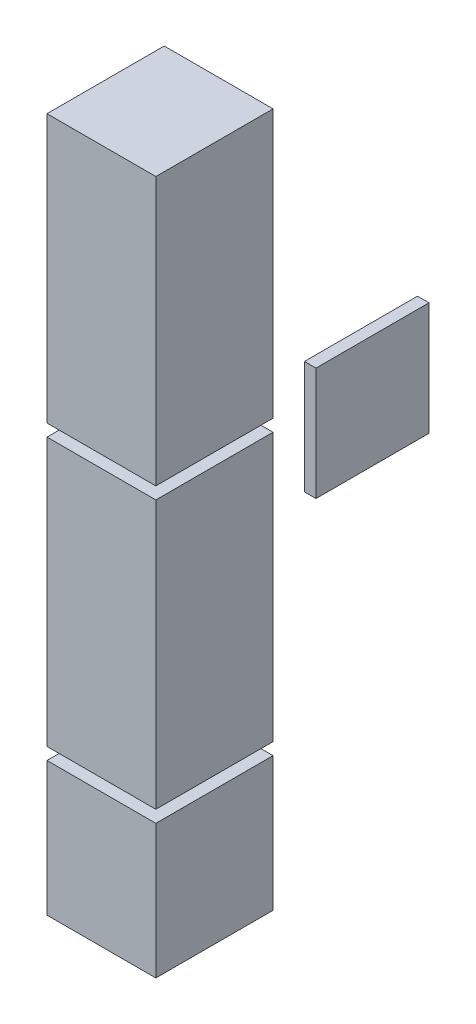
ISO-10303-21;
HEADER;
FILE_DESCRIPTION(('STEP AP214'),'2;1');
FILE_NAME('part.step','',(''),(''),'','','');
FILE_SCHEMA(('AUTOMOTIVE_DESIGN { 1 0 10303 214 1 1 1 1 }'));
ENDSEC;
DATA;
#1=APPLICATION_CONTEXT('core data for automotive mechanical design processes');
#2=APPLICATION_PROTOCOL_DEFINITION('international standard','automotive_design',2000,#1);
#3=PRODUCT_CONTEXT('',#1,'mechanical');
#4=PRODUCT('Part','Part','',(#3));
#5=PRODUCT_RELATED_PRODUCT_CATEGORY('part','',(#4));
#6=PRODUCT_DEFINITION_FORMATION('','',#4);
#7=PRODUCT_DEFINITION_CONTEXT('part definition',#1,'design');
#8=PRODUCT_DEFINITION('design','',#6,#7);
#9=PRODUCT_DEFINITION_SHAPE('','',#8);
#10=(LENGTH_UNIT() NAMED_UNIT(*) SI_UNIT(.MILLI.,.METRE.));
#11=(NAMED_UNIT(*) PLANE_ANGLE_UNIT() SI_UNIT($,.RADIAN.));
#12=(NAMED_UNIT(*) SI_UNIT($,.STERADIAN.) SOLID_ANGLE_UNIT());
#13=UNCERTAINTY_MEASURE_WITH_UNIT(LENGTH_MEASURE(1.E-05),#10,'distance_accuracy_value','');
#14=(GEOMETRIC_REPRESENTATION_CONTEXT(3) GLOBAL_UNCERTAINTY_ASSIGNED_CONTEXT((#13)) GLOBAL_UNIT_ASSIGNED_CONTEXT((#10,
#11,#12)) REPRESENTATION_CONTEXT('',''));
#15=CARTESIAN_POINT('',(0.,0.,0.));
#16=DIRECTION('',(0.,0.,1.));
#17=DIRECTION('',(1.,0.,0.));
#18=AXIS2_PLACEMENT_3D('',#15,#16,#17);
#19=CARTESIAN_POINT('',(4.3375,133.,-56.5));
#20=DIRECTION('',(0.,0.,-1.));
#21=DIRECTION('',(-1.,0.,0.));
#22=AXIS2_PLACEMENT_3D('',#19,#20,#21);
#23=PLANE('',#22);
#24=DIRECTION('',(0.,-1.,0.));
#25=VECTOR('',#24,1.);
#26=CARTESIAN_POINT('',(1.5875,133.,-56.5));
#27=LINE('',#26,#25);
#28=CARTESIAN_POINT('',(1.5875,133.,-56.5));
#29=VERTEX_POINT('',#28);
#30=CARTESIAN_POINT('',(1.5875,106.,-56.5));
#31=VERTEX_POINT('',#30);
#32=EDGE_CURVE('E107',#29,#31,#27,.T.);
#33=ORIENTED_EDGE('',*,*,#32,.T.);
#34=DIRECTION('',(-1.,0.,0.));
#35=VECTOR('',#34,1.);
#36=CARTESIAN_POINT('',(4.3375,106.,-56.5));
#37=LINE('',#36,#35);
#38=CARTESIAN_POINT('',(4.3375,106.,-56.5));
#39=VERTEX_POINT('',#38);
#40=EDGE_CURVE('E12',#39,#31,#37,.T.);
#41=ORIENTED_EDGE('',*,*,#40,.F.);
#42=DIRECTION('',(0.,-1.,0.));
#43=VECTOR('',#42,1.);
#44=CARTESIAN_POINT('',(4.3375,133.,-56.5));
#45=LINE('',#44,#43);
#46=CARTESIAN_POINT('',(4.3375,133.,-56.5));
#47=VERTEX_POINT('',#46);
#48=EDGE_CURVE('E95',#47,#39,#45,.T.);
#49=ORIENTED_EDGE('',*,*,#48,.F.);
#50=DIRECTION('',(-1.,0.,0.));
#51=VECTOR('',#50,1.);
#52=CARTESIAN_POINT('',(4.3375,133.,-56.5));
#53=LINE('',#52,#51);
#54=EDGE_CURVE('E103',#47,#29,#53,.T.);
#55=ORIENTED_EDGE('',*,*,#54,.T.);
#56=EDGE_LOOP('',(#33,#41,#49,#55));
#57=FACE_BOUND('',#56,.T.);
#58=ADVANCED_FACE('F44',(#57),#23,.F.);
#59=CARTESIAN_POINT('',(4.3375,106.,-56.5));
#60=DIRECTION('',(0.,1.,0.));
#61=DIRECTION('',(0.,0.,1.));
#62=AXIS2_PLACEMENT_3D('',#59,#60,#61);
#63=PLANE('',#62);
#64=DIRECTION('',(0.,0.,-1.));
#65=VECTOR('',#64,1.);
#66=CARTESIAN_POINT('',(1.5875,106.,-56.5));
#67=LINE('',#66,#65);
#68=CARTESIAN_POINT('',(1.5875,106.,-83.5));
#69=VERTEX_POINT('',#68);
#70=EDGE_CURVE('E99',#31,#69,#67,.T.);
#71=ORIENTED_EDGE('',*,*,#70,.T.);
#72=DIRECTION('',(-1.,0.,0.));
#73=VECTOR('',#72,1.);
#74=CARTESIAN_POINT('',(4.3375,106.,-83.5));
#75=LINE('',#74,#73);
#76=CARTESIAN_POINT('',(4.3375,106.,-83.5));
#77=VERTEX_POINT('',#76);
#78=EDGE_CURVE('E52',#77,#69,#75,.T.);
#79=ORIENTED_EDGE('',*,*,#78,.F.);
#80=DIRECTION('',(0.,0.,-1.));
#81=VECTOR('',#80,1.);
#82=CARTESIAN_POINT('',(4.3375,106.,-56.5));
#83=LINE('',#82,#81);
#84=EDGE_CURVE('E90',#39,#77,#83,.T.);
#85=ORIENTED_EDGE('',*,*,#84,.F.);
#86=ORIENTED_EDGE('',*,*,#40,.T.);
#87=EDGE_LOOP('',(#71,#79,#85,#86));
#88=FACE_BOUND('',#87,.T.);
#89=ADVANCED_FACE('F98',(#88),#63,.F.);
#90=CARTESIAN_POINT('',(4.3375,133.,-83.5));
#91=DIRECTION('',(0.,0.,1.));
#92=DIRECTION('',(1.,0.,0.));
#93=AXIS2_PLACEMENT_3D('',#90,#91,#92);
#94=PLANE('',#93);
#95=DIRECTION('',(0.,1.,0.));
#96=VECTOR('',#95,1.);
#97=CARTESIAN_POINT('',(1.5875,133.,-83.5));
#98=LINE('',#97,#96);
#99=CARTESIAN_POINT('',(1.5875,133.,-83.5));
#100=VERTEX_POINT('',#99);
#101=EDGE_CURVE('E77',#69,#100,#98,.T.);
#102=ORIENTED_EDGE('',*,*,#101,.T.);
#103=DIRECTION('',(-1.,0.,0.));
#104=VECTOR('',#103,1.);
#105=CARTESIAN_POINT('',(4.3375,133.,-83.5));
#106=LINE('',#105,#104);
#107=CARTESIAN_POINT('',(4.3375,133.,-83.5));
#108=VERTEX_POINT('',#107);
#109=EDGE_CURVE('E100',#108,#100,#106,.T.);
#110=ORIENTED_EDGE('',*,*,#109,.F.);
#111=DIRECTION('',(0.,1.,0.));
#112=VECTOR('',#111,1.);
#113=CARTESIAN_POINT('',(4.3375,133.,-83.5));
#114=LINE('',#113,#112);
#115=EDGE_CURVE('E93',#77,#108,#114,.T.);
#116=ORIENTED_EDGE('',*,*,#115,.F.);
#117=ORIENTED_EDGE('',*,*,#78,.T.);
#118=EDGE_LOOP('',(#102,#110,#116,#117));
#119=FACE_BOUND('',#118,.T.);
#120=ADVANCED_FACE('F101',(#119),#94,.F.);
#121=CARTESIAN_POINT('',(4.3375,133.,-56.5));
#122=DIRECTION('',(0.,-1.,0.));
#123=DIRECTION('',(0.,0.,-1.));
#124=AXIS2_PLACEMENT_3D('',#121,#122,#123);
#125=PLANE('',#124);
#126=DIRECTION('',(0.,0.,1.));
#127=VECTOR('',#126,1.);
#128=CARTESIAN_POINT('',(1.5875,133.,-56.5));
#129=LINE('',#128,#127);
#130=EDGE_CURVE('E83',#100,#29,#129,.T.);
#131=ORIENTED_EDGE('',*,*,#130,.T.);
#132=ORIENTED_EDGE('',*,*,#54,.F.);
#133=DIRECTION('',(0.,0.,1.));
#134=VECTOR('',#133,1.);
#135=CARTESIAN_POINT('',(4.3375,133.,-56.5));
#136=LINE('',#135,#134);
#137=EDGE_CURVE('E60',#108,#47,#136,.T.);
#138=ORIENTED_EDGE('',*,*,#137,.F.);
#139=ORIENTED_EDGE('',*,*,#109,.T.);
#140=EDGE_LOOP('',(#131,#132,#138,#139));
#141=FACE_BOUND('',#140,.T.);
#142=ADVANCED_FACE('F114',(#141),#125,.F.);
#143=CARTESIAN_POINT('',(4.3375,0.,0.));
#144=DIRECTION('',(1.,0.,0.));
#145=DIRECTION('',(0.,0.,-1.));
#146=AXIS2_PLACEMENT_3D('',#143,#144,#145);
#147=PLANE('',#146);
#148=ORIENTED_EDGE('',*,*,#48,.T.);
#149=ORIENTED_EDGE('',*,*,#84,.T.);
#150=ORIENTED_EDGE('',*,*,#115,.T.);
#151=ORIENTED_EDGE('',*,*,#137,.T.);
#152=EDGE_LOOP('',(#148,#149,#150,#151));
#153=FACE_BOUND('',#152,.T.);
#154=ADVANCED_FACE('F91',(#153),#147,.T.);
#155=CARTESIAN_POINT('',(1.5875,0.,0.));
#156=DIRECTION('',(1.,0.,0.));
#157=DIRECTION('',(0.,0.,-1.));
#158=AXIS2_PLACEMENT_3D('',#155,#156,#157);
#159=PLANE('',#158);
#160=ORIENTED_EDGE('',*,*,#32,.F.);
#161=ORIENTED_EDGE('',*,*,#130,.F.);
#162=ORIENTED_EDGE('',*,*,#101,.F.);
#163=ORIENTED_EDGE('',*,*,#70,.F.);
#164=EDGE_LOOP('',(#160,#161,#162,#163));
#165=FACE_BOUND('',#164,.T.);
#166=ADVANCED_FACE('F117',(#165),#159,.F.);
#167=CLOSED_SHELL('',(#58,#89,#120,#142,#154,#166));
#168=MANIFOLD_SOLID_BREP('B2',#167);
#169=CARTESIAN_POINT('',(27.5875,148.1,5.));
#170=DIRECTION('',(0.,0.,-1.));
#171=DIRECTION('',(0.,1.,0.));
#172=AXIS2_PLACEMENT_3D('',#169,#170,#171);
#173=PLANE('',#172);
#174=DIRECTION('',(0.,-1.,0.));
#175=VECTOR('',#174,1.);
#176=CARTESIAN_POINT('',(1.5875,148.1,5.));
#177=LINE('',#176,#175);
#178=CARTESIAN_POINT('',(1.5875,148.1,5.));
#179=VERTEX_POINT('',#178);
#180=CARTESIAN_POINT('',(1.5875,84.1,4.99999999999999));
#181=VERTEX_POINT('',#180);
#182=EDGE_CURVE('E240',#179,#181,#177,.T.);
#183=ORIENTED_EDGE('',*,*,#182,.T.);
#184=DIRECTION('',(-1.,0.,0.));
#185=VECTOR('',#184,1.);
#186=CARTESIAN_POINT('',(27.5875,84.1,4.99999999999999));
#187=LINE('',#186,#185);
#188=CARTESIAN_POINT('',(27.5875,84.1,4.99999999999999));
#189=VERTEX_POINT('',#188);
#190=EDGE_CURVE('E42',#189,#181,#187,.T.);
#191=ORIENTED_EDGE('',*,*,#190,.F.);
#192=DIRECTION('',(0.,-1.,0.));
#193=VECTOR('',#192,1.);
#194=CARTESIAN_POINT('',(27.5875,148.1,5.));
#195=LINE('',#194,#193);
#196=CARTESIAN_POINT('',(27.5875,148.1,5.));
#197=VERTEX_POINT('',#196);
#198=EDGE_CURVE('E228',#197,#189,#195,.T.);
#199=ORIENTED_EDGE('',*,*,#198,.F.);
#200=DIRECTION('',(-1.,0.,0.));
#201=VECTOR('',#200,1.);
#202=CARTESIAN_POINT('',(27.5875,148.1,5.));
#203=LINE('',#202,#201);
#204=EDGE_CURVE('E236',#197,#179,#203,.T.);
#205=ORIENTED_EDGE('',*,*,#204,.T.);
#206=EDGE_LOOP('',(#183,#191,#199,#205));
#207=FACE_BOUND('',#206,.T.);
#208=ADVANCED_FACE('F177',(#207),#173,.F.);
#209=CARTESIAN_POINT('',(27.5875,84.1,4.99999999999999));
#210=DIRECTION('',(0.,1.,0.));
#211=DIRECTION('',(0.,0.,1.));
#212=AXIS2_PLACEMENT_3D('',#209,#210,#211);
#213=PLANE('',#212);
#214=DIRECTION('',(0.,0.,-1.));
#215=VECTOR('',#214,1.);
#216=CARTESIAN_POINT('',(1.5875,84.1,4.99999999999999));
#217=LINE('',#216,#215);
#218=CARTESIAN_POINT('',(1.5875,84.1,-23.));
#219=VERTEX_POINT('',#218);
#220=EDGE_CURVE('E232',#181,#219,#217,.T.);
#221=ORIENTED_EDGE('',*,*,#220,.T.);
#222=DIRECTION('',(-1.,0.,0.));
#223=VECTOR('',#222,1.);
#224=CARTESIAN_POINT('',(27.5875,84.1,-23.));
#225=LINE('',#224,#223);
#226=CARTESIAN_POINT('',(27.5875,84.1,-23.));
#227=VERTEX_POINT('',#226);
#228=EDGE_CURVE('E185',#227,#219,#225,.T.);
#229=ORIENTED_EDGE('',*,*,#228,.F.);
#230=DIRECTION('',(0.,0.,-1.));
#231=VECTOR('',#230,1.);
#232=CARTESIAN_POINT('',(27.5875,84.1,4.99999999999999));
#233=LINE('',#232,#231);
#234=EDGE_CURVE('E223',#189,#227,#233,.T.);
#235=ORIENTED_EDGE('',*,*,#234,.F.);
#236=ORIENTED_EDGE('',*,*,#190,.T.);
#237=EDGE_LOOP('',(#221,#229,#235,#236));
#238=FACE_BOUND('',#237,.T.);
#239=ADVANCED_FACE('F231',(#238),#213,.F.);
#240=CARTESIAN_POINT('',(27.5875,148.1,-23.));
#241=DIRECTION('',(0.,0.,1.));
#242=DIRECTION('',(0.,-1.,0.));
#243=AXIS2_PLACEMENT_3D('',#240,#241,#242);
#244=PLANE('',#243);
#245=DIRECTION('',(0.,1.,0.));
#246=VECTOR('',#245,1.);
#247=CARTESIAN_POINT('',(1.5875,148.1,-23.));
#248=LINE('',#247,#246);
#249=CARTESIAN_POINT('',(1.5875,148.1,-23.));
#250=VERTEX_POINT('',#249);
#251=EDGE_CURVE('E210',#219,#250,#248,.T.);
#252=ORIENTED_EDGE('',*,*,#251,.T.);
#253=DIRECTION('',(-1.,0.,0.));
#254=VECTOR('',#253,1.);
#255=CARTESIAN_POINT('',(27.5875,148.1,-23.));
#256=LINE('',#255,#254);
#257=CARTESIAN_POINT('',(27.5875,148.1,-23.));
#258=VERTEX_POINT('',#257);
#259=EDGE_CURVE('E233',#258,#250,#256,.T.);
#260=ORIENTED_EDGE('',*,*,#259,.F.);
#261=DIRECTION('',(0.,1.,0.));
#262=VECTOR('',#261,1.);
#263=CARTESIAN_POINT('',(27.5875,148.1,-23.));
#264=LINE('',#263,#262);
#265=EDGE_CURVE('E226',#227,#258,#264,.T.);
#266=ORIENTED_EDGE('',*,*,#265,.F.);
#267=ORIENTED_EDGE('',*,*,#228,.T.);
#268=EDGE_LOOP('',(#252,#260,#266,#267));
#269=FACE_BOUND('',#268,.T.);
#270=ADVANCED_FACE('F234',(#269),#244,.F.);
#271=CARTESIAN_POINT('',(27.5875,148.1,5.));
#272=DIRECTION('',(0.,-1.,0.));
#273=DIRECTION('',(0.,0.,-1.));
#274=AXIS2_PLACEMENT_3D('',#271,#272,#273);
#275=PLANE('',#274);
#276=DIRECTION('',(0.,0.,1.));
#277=VECTOR('',#276,1.);
#278=CARTESIAN_POINT('',(1.5875,148.1,5.));
#279=LINE('',#278,#277);
#280=EDGE_CURVE('E216',#250,#179,#279,.T.);
#281=ORIENTED_EDGE('',*,*,#280,.T.);
#282=ORIENTED_EDGE('',*,*,#204,.F.);
#283=DIRECTION('',(0.,0.,1.));
#284=VECTOR('',#283,1.);
#285=CARTESIAN_POINT('',(27.5875,148.1,5.));
#286=LINE('',#285,#284);
#287=EDGE_CURVE('E193',#258,#197,#286,.T.);
#288=ORIENTED_EDGE('',*,*,#287,.F.);
#289=ORIENTED_EDGE('',*,*,#259,.T.);
#290=EDGE_LOOP('',(#281,#282,#288,#289));
#291=FACE_BOUND('',#290,.T.);
#292=ADVANCED_FACE('F247',(#291),#275,.F.);
#293=CARTESIAN_POINT('',(27.5875,0.,0.));
#294=DIRECTION('',(1.,0.,0.));
#295=DIRECTION('',(0.,0.,-1.));
#296=AXIS2_PLACEMENT_3D('',#293,#294,#295);
#297=PLANE('',#296);
#298=ORIENTED_EDGE('',*,*,#198,.T.);
#299=ORIENTED_EDGE('',*,*,#234,.T.);
#300=ORIENTED_EDGE('',*,*,#265,.T.);
#301=ORIENTED_EDGE('',*,*,#287,.T.);
#302=EDGE_LOOP('',(#298,#299,#300,#301));
#303=FACE_BOUND('',#302,.T.);
#304=ADVANCED_FACE('F224',(#303),#297,.T.);
#305=CARTESIAN_POINT('',(1.5875,0.,0.));
#306=DIRECTION('',(1.,0.,0.));
#307=DIRECTION('',(0.,0.,-1.));
#308=AXIS2_PLACEMENT_3D('',#305,#306,#307);
#309=PLANE('',#308);
#310=ORIENTED_EDGE('',*,*,#182,.F.);
#311=ORIENTED_EDGE('',*,*,#280,.F.);
#312=ORIENTED_EDGE('',*,*,#251,.F.);
#313=ORIENTED_EDGE('',*,*,#220,.F.);
#314=EDGE_LOOP('',(#310,#311,#312,#313));
#315=FACE_BOUND('',#314,.T.);
#316=ADVANCED_FACE('F250',(#315),#309,.F.);
#317=CLOSED_SHELL('',(#208,#239,#270,#292,#304,#316));
#318=MANIFOLD_SOLID_BREP('B6',#317);
#319=CARTESIAN_POINT('',(27.5875,81.2,-23.));
#320=DIRECTION('',(0.,0.,1.));
#321=DIRECTION('',(0.,-1.,0.));
#322=AXIS2_PLACEMENT_3D('',#319,#320,#321);
#323=PLANE('',#322);
#324=DIRECTION('',(0.,1.,0.));
#325=VECTOR('',#324,1.);
#326=CARTESIAN_POINT('',(1.5875,81.2,-23.));
#327=LINE('',#326,#325);
#328=CARTESIAN_POINT('',(1.5875,49.2,-23.));
#329=VERTEX_POINT('',#328);
#330=CARTESIAN_POINT('',(1.5875,81.2,-23.));
#331=VERTEX_POINT('',#330);
#332=EDGE_CURVE('E372',#329,#331,#327,.T.);
#333=ORIENTED_EDGE('',*,*,#332,.T.);
#334=DIRECTION('',(-1.,0.,0.));
#335=VECTOR('',#334,1.);
#336=CARTESIAN_POINT('',(27.5875,81.2,-23.));
#337=LINE('',#336,#335);
#338=CARTESIAN_POINT('',(27.5875,81.2,-23.));
#339=VERTEX_POINT('',#338);
#340=EDGE_CURVE('E175',#339,#331,#337,.T.);
#341=ORIENTED_EDGE('',*,*,#340,.F.);
#342=DIRECTION('',(0.,1.,0.));
#343=VECTOR('',#342,1.);
#344=CARTESIAN_POINT('',(27.5875,81.2,-23.));
#345=LINE('',#344,#343);
#346=CARTESIAN_POINT('',(27.5875,49.2,-23.));
#347=VERTEX_POINT('',#346);
#348=EDGE_CURVE('E360',#347,#339,#345,.T.);
#349=ORIENTED_EDGE('',*,*,#348,.F.);
#350=DIRECTION('',(-1.,0.,0.));
#351=VECTOR('',#350,1.);
#352=CARTESIAN_POINT('',(27.5875,49.2,-23.));
#353=LINE('',#352,#351);
#354=EDGE_CURVE('E368',#347,#329,#353,.T.);
#355=ORIENTED_EDGE('',*,*,#354,.T.);
#356=EDGE_LOOP('',(#333,#341,#349,#355));
#357=FACE_BOUND('',#356,.T.);
#358=ADVANCED_FACE('F309',(#357),#323,.F.);
#359=CARTESIAN_POINT('',(27.5875,81.2,5.));
#360=DIRECTION('',(0.,-1.,0.));
#361=DIRECTION('',(0.,0.,-1.));
#362=AXIS2_PLACEMENT_3D('',#359,#360,#361);
#363=PLANE('',#362);
#364=DIRECTION('',(0.,0.,1.));
#365=VECTOR('',#364,1.);
#366=CARTESIAN_POINT('',(1.5875,81.2,5.));
#367=LINE('',#366,#365);
#368=CARTESIAN_POINT('',(1.5875,81.2,5.));
#369=VERTEX_POINT('',#368);
#370=EDGE_CURVE('E364',#331,#369,#367,.T.);
#371=ORIENTED_EDGE('',*,*,#370,.T.);
#372=DIRECTION('',(-1.,0.,0.));
#373=VECTOR('',#372,1.);
#374=CARTESIAN_POINT('',(27.5875,81.2,5.));
#375=LINE('',#374,#373);
#376=CARTESIAN_POINT('',(27.5875,81.2,5.));
#377=VERTEX_POINT('',#376);
#378=EDGE_CURVE('E317',#377,#369,#375,.T.);
#379=ORIENTED_EDGE('',*,*,#378,.F.);
#380=DIRECTION('',(0.,0.,1.));
#381=VECTOR('',#380,1.);
#382=CARTESIAN_POINT('',(27.5875,81.2,5.));
#383=LINE('',#382,#381);
#384=EDGE_CURVE('E355',#339,#377,#383,.T.);
#385=ORIENTED_EDGE('',*,*,#384,.F.);
#386=ORIENTED_EDGE('',*,*,#340,.T.);
#387=EDGE_LOOP('',(#371,#379,#385,#386));
#388=FACE_BOUND('',#387,.T.);
#389=ADVANCED_FACE('F363',(#388),#363,.F.);
#390=CARTESIAN_POINT('',(27.5875,81.2,5.));
#391=DIRECTION('',(0.,0.,-1.));
#392=DIRECTION('',(0.,1.,0.));
#393=AXIS2_PLACEMENT_3D('',#390,#391,#392);
#394=PLANE('',#393);
#395=DIRECTION('',(0.,-1.,0.));
#396=VECTOR('',#395,1.);
#397=CARTESIAN_POINT('',(1.5875,81.2,5.));
#398=LINE('',#397,#396);
#399=CARTESIAN_POINT('',(1.5875,49.2,5.));
#400=VERTEX_POINT('',#399);
#401=EDGE_CURVE('E342',#369,#400,#398,.T.);
#402=ORIENTED_EDGE('',*,*,#401,.T.);
#403=DIRECTION('',(-1.,0.,0.));
#404=VECTOR('',#403,1.);
#405=CARTESIAN_POINT('',(27.5875,49.2,5.));
#406=LINE('',#405,#404);
#407=CARTESIAN_POINT('',(27.5875,49.2,5.));
#408=VERTEX_POINT('',#407);
#409=EDGE_CURVE('E365',#408,#400,#406,.T.);
#410=ORIENTED_EDGE('',*,*,#409,.F.);
#411=DIRECTION('',(0.,-1.,0.));
#412=VECTOR('',#411,1.);
#413=CARTESIAN_POINT('',(27.5875,81.2,5.));
#414=LINE('',#413,#412);
#415=EDGE_CURVE('E358',#377,#408,#414,.T.);
#416=ORIENTED_EDGE('',*,*,#415,.F.);
#417=ORIENTED_EDGE('',*,*,#378,.T.);
#418=EDGE_LOOP('',(#402,#410,#416,#417));
#419=FACE_BOUND('',#418,.T.);
#420=ADVANCED_FACE('F366',(#419),#394,.F.);
#421=CARTESIAN_POINT('',(27.5875,49.2,5.));
#422=DIRECTION('',(0.,1.,0.));
#423=DIRECTION('',(0.,0.,1.));
#424=AXIS2_PLACEMENT_3D('',#421,#422,#423);
#425=PLANE('',#424);
#426=DIRECTION('',(0.,0.,-1.));
#427=VECTOR('',#426,1.);
#428=CARTESIAN_POINT('',(1.5875,49.2,5.));
#429=LINE('',#428,#427);
#430=EDGE_CURVE('E348',#400,#329,#429,.T.);
#431=ORIENTED_EDGE('',*,*,#430,.T.);
#432=ORIENTED_EDGE('',*,*,#354,.F.);
#433=DIRECTION('',(0.,0.,-1.));
#434=VECTOR('',#433,1.);
#435=CARTESIAN_POINT('',(27.5875,49.2,5.));
#436=LINE('',#435,#434);
#437=EDGE_CURVE('E325',#408,#347,#436,.T.);
#438=ORIENTED_EDGE('',*,*,#437,.F.);
#439=ORIENTED_EDGE('',*,*,#409,.T.);
#440=EDGE_LOOP('',(#431,#432,#438,#439));
#441=FACE_BOUND('',#440,.T.);
#442=ADVANCED_FACE('F379',(#441),#425,.F.);
#443=CARTESIAN_POINT('',(27.5875,0.,0.));
#444=DIRECTION('',(1.,0.,0.));
#445=DIRECTION('',(0.,0.,-1.));
#446=AXIS2_PLACEMENT_3D('',#443,#444,#445);
#447=PLANE('',#446);
#448=ORIENTED_EDGE('',*,*,#348,.T.);
#449=ORIENTED_EDGE('',*,*,#384,.T.);
#450=ORIENTED_EDGE('',*,*,#415,.T.);
#451=ORIENTED_EDGE('',*,*,#437,.T.);
#452=EDGE_LOOP('',(#448,#449,#450,#451));
#453=FACE_BOUND('',#452,.T.);
#454=ADVANCED_FACE('F356',(#453),#447,.T.);
#455=CARTESIAN_POINT('',(1.5875,0.,0.));
#456=DIRECTION('',(1.,0.,0.));
#457=DIRECTION('',(0.,0.,-1.));
#458=AXIS2_PLACEMENT_3D('',#455,#456,#457);
#459=PLANE('',#458);
#460=ORIENTED_EDGE('',*,*,#332,.F.);
#461=ORIENTED_EDGE('',*,*,#430,.F.);
#462=ORIENTED_EDGE('',*,*,#401,.F.);
#463=ORIENTED_EDGE('',*,*,#370,.F.);
#464=EDGE_LOOP('',(#460,#461,#462,#463));
#465=FACE_BOUND('',#464,.T.);
#466=ADVANCED_FACE('F382',(#465),#459,.F.);
#467=CLOSED_SHELL('',(#358,#389,#420,#442,#454,#466));
#468=MANIFOLD_SOLID_BREP('B36',#467);
#469=CARTESIAN_POINT('',(27.5875,215.,5.));
#470=DIRECTION('',(0.,0.,-1.));
#471=DIRECTION('',(0.,1.,0.));
#472=AXIS2_PLACEMENT_3D('',#469,#470,#471);
#473=PLANE('',#472);
#474=DIRECTION('',(0.,-1.,0.));
#475=VECTOR('',#474,1.);
#476=CARTESIAN_POINT('',(1.5875,215.,5.));
#477=LINE('',#476,#475);
#478=CARTESIAN_POINT('',(1.5875,215.,5.));
#479=VERTEX_POINT('',#478);
#480=CARTESIAN_POINT('',(1.5875,151.,4.99999999999999));
#481=VERTEX_POINT('',#480);
#482=EDGE_CURVE('E495',#479,#481,#477,.T.);
#483=ORIENTED_EDGE('',*,*,#482,.T.);
#484=DIRECTION('',(-1.,0.,0.));
#485=VECTOR('',#484,1.);
#486=CARTESIAN_POINT('',(27.5875,151.,4.99999999999999));
#487=LINE('',#486,#485);
#488=CARTESIAN_POINT('',(27.5875,151.,4.99999999999999));
#489=VERTEX_POINT('',#488);
#490=EDGE_CURVE('E307',#489,#481,#487,.T.);
#491=ORIENTED_EDGE('',*,*,#490,.F.);
#492=DIRECTION('',(0.,-1.,0.));
#493=VECTOR('',#492,1.);
#494=CARTESIAN_POINT('',(27.5875,215.,5.));
#495=LINE('',#494,#493);
#496=CARTESIAN_POINT('',(27.5875,215.,5.));
#497=VERTEX_POINT('',#496);
#498=EDGE_CURVE('E483',#497,#489,#495,.T.);
#499=ORIENTED_EDGE('',*,*,#498,.F.);
#500=DIRECTION('',(-1.,0.,0.));
#501=VECTOR('',#500,1.);
#502=CARTESIAN_POINT('',(27.5875,215.,5.));
#503=LINE('',#502,#501);
#504=EDGE_CURVE('E491',#497,#479,#503,.T.);
#505=ORIENTED_EDGE('',*,*,#504,.T.);
#506=EDGE_LOOP('',(#483,#491,#499,#505));
#507=FACE_BOUND('',#506,.T.);
#508=ADVANCED_FACE('F432',(#507),#473,.F.);
#509=CARTESIAN_POINT('',(27.5875,151.,4.99999999999999));
#510=DIRECTION('',(0.,1.,0.));
#511=DIRECTION('',(0.,0.,1.));
#512=AXIS2_PLACEMENT_3D('',#509,#510,#511);
#513=PLANE('',#512);
#514=DIRECTION('',(0.,0.,-1.));
#515=VECTOR('',#514,1.);
#516=CARTESIAN_POINT('',(1.5875,151.,4.99999999999999));
#517=LINE('',#516,#515);
#518=CARTESIAN_POINT('',(1.5875,151.,-23.));
#519=VERTEX_POINT('',#518);
#520=EDGE_CURVE('E487',#481,#519,#517,.T.);
#521=ORIENTED_EDGE('',*,*,#520,.T.);
#522=DIRECTION('',(-1.,0.,0.));
#523=VECTOR('',#522,1.);
#524=CARTESIAN_POINT('',(27.5875,151.,-23.));
#525=LINE('',#524,#523);
#526=CARTESIAN_POINT('',(27.5875,151.,-23.));
#527=VERTEX_POINT('',#526);
#528=EDGE_CURVE('E440',#527,#519,#525,.T.);
#529=ORIENTED_EDGE('',*,*,#528,.F.);
#530=DIRECTION('',(0.,0.,-1.));
#531=VECTOR('',#530,1.);
#532=CARTESIAN_POINT('',(27.5875,151.,4.99999999999999));
#533=LINE('',#532,#531);
#534=EDGE_CURVE('E478',#489,#527,#533,.T.);
#535=ORIENTED_EDGE('',*,*,#534,.F.);
#536=ORIENTED_EDGE('',*,*,#490,.T.);
#537=EDGE_LOOP('',(#521,#529,#535,#536));
#538=FACE_BOUND('',#537,.T.);
#539=ADVANCED_FACE('F486',(#538),#513,.F.);
#540=CARTESIAN_POINT('',(27.5875,215.,-23.));
#541=DIRECTION('',(0.,0.,1.));
#542=DIRECTION('',(0.,-1.,0.));
#543=AXIS2_PLACEMENT_3D('',#540,#541,#542);
#544=PLANE('',#543);
#545=DIRECTION('',(0.,1.,0.));
#546=VECTOR('',#545,1.);
#547=CARTESIAN_POINT('',(1.5875,215.,-23.));
#548=LINE('',#547,#546);
#549=CARTESIAN_POINT('',(1.5875,215.,-23.));
#550=VERTEX_POINT('',#549);
#551=EDGE_CURVE('E465',#519,#550,#548,.T.);
#552=ORIENTED_EDGE('',*,*,#551,.T.);
#553=DIRECTION('',(-1.,0.,0.));
#554=VECTOR('',#553,1.);
#555=CARTESIAN_POINT('',(27.5875,215.,-23.));
#556=LINE('',#555,#554);
#557=CARTESIAN_POINT('',(27.5875,215.,-23.));
#558=VERTEX_POINT('',#557);
#559=EDGE_CURVE('E488',#558,#550,#556,.T.);
#560=ORIENTED_EDGE('',*,*,#559,.F.);
#561=DIRECTION('',(0.,1.,0.));
#562=VECTOR('',#561,1.);
#563=CARTESIAN_POINT('',(27.5875,215.,-23.));
#564=LINE('',#563,#562);
#565=EDGE_CURVE('E481',#527,#558,#564,.T.);
#566=ORIENTED_EDGE('',*,*,#565,.F.);
#567=ORIENTED_EDGE('',*,*,#528,.T.);
#568=EDGE_LOOP('',(#552,#560,#566,#567));
#569=FACE_BOUND('',#568,.T.);
#570=ADVANCED_FACE('F489',(#569),#544,.F.);
#571=CARTESIAN_POINT('',(27.5875,215.,5.));
#572=DIRECTION('',(0.,-1.,0.));
#573=DIRECTION('',(0.,0.,-1.));
#574=AXIS2_PLACEMENT_3D('',#571,#572,#573);
#575=PLANE('',#574);
#576=DIRECTION('',(0.,0.,1.));
#577=VECTOR('',#576,1.);
#578=CARTESIAN_POINT('',(1.5875,215.,5.));
#579=LINE('',#578,#577);
#580=EDGE_CURVE('E471',#550,#479,#579,.T.);
#581=ORIENTED_EDGE('',*,*,#580,.T.);
#582=ORIENTED_EDGE('',*,*,#504,.F.);
#583=DIRECTION('',(0.,0.,1.));
#584=VECTOR('',#583,1.);
#585=CARTESIAN_POINT('',(27.5875,215.,5.));
#586=LINE('',#585,#584);
#587=EDGE_CURVE('E448',#558,#497,#586,.T.);
#588=ORIENTED_EDGE('',*,*,#587,.F.);
#589=ORIENTED_EDGE('',*,*,#559,.T.);
#590=EDGE_LOOP('',(#581,#582,#588,#589));
#591=FACE_BOUND('',#590,.T.);
#592=ADVANCED_FACE('F502',(#591),#575,.F.);
#593=CARTESIAN_POINT('',(27.5875,0.,0.));
#594=DIRECTION('',(1.,0.,0.));
#595=DIRECTION('',(0.,0.,-1.));
#596=AXIS2_PLACEMENT_3D('',#593,#594,#595);
#597=PLANE('',#596);
#598=ORIENTED_EDGE('',*,*,#498,.T.);
#599=ORIENTED_EDGE('',*,*,#534,.T.);
#600=ORIENTED_EDGE('',*,*,#565,.T.);
#601=ORIENTED_EDGE('',*,*,#587,.T.);
#602=EDGE_LOOP('',(#598,#599,#600,#601));
#603=FACE_BOUND('',#602,.T.);
#604=ADVANCED_FACE('F479',(#603),#597,.T.);
#605=CARTESIAN_POINT('',(1.5875,0.,0.));
#606=DIRECTION('',(1.,0.,0.));
#607=DIRECTION('',(0.,0.,-1.));
#608=AXIS2_PLACEMENT_3D('',#605,#606,#607);
#609=PLANE('',#608);
#610=ORIENTED_EDGE('',*,*,#482,.F.);
#611=ORIENTED_EDGE('',*,*,#580,.F.);
#612=ORIENTED_EDGE('',*,*,#551,.F.);
#613=ORIENTED_EDGE('',*,*,#520,.F.);
#614=EDGE_LOOP('',(#610,#611,#612,#613));
#615=FACE_BOUND('',#614,.T.);
#616=ADVANCED_FACE('F505',(#615),#609,.F.);
#617=CLOSED_SHELL('',(#508,#539,#570,#592,#604,#616));
#618=MANIFOLD_SOLID_BREP('B169',#617);
#619=ADVANCED_BREP_SHAPE_REPRESENTATION('',(#18,#168,#318,#468,#618),#14);
#620=SHAPE_DEFINITION_REPRESENTATION(#9,#619);
ENDSEC;
END-ISO-10303-21;
